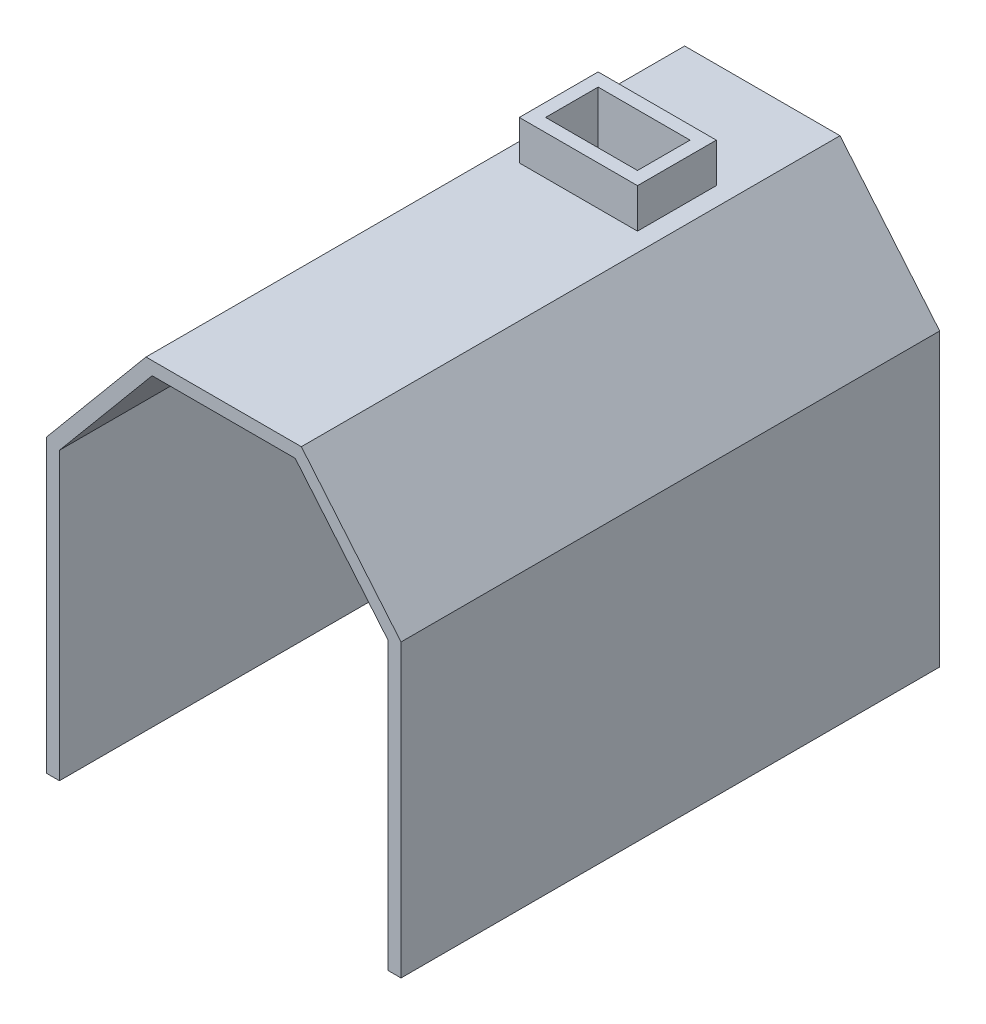
ISO-10303-21;
HEADER;
FILE_DESCRIPTION(('STEP AP214'),'2;1');
FILE_NAME('part.step','',(''),(''),'','','');
FILE_SCHEMA(('AUTOMOTIVE_DESIGN { 1 0 10303 214 1 1 1 1 }'));
ENDSEC;
DATA;
#1=APPLICATION_CONTEXT('core data for automotive mechanical design processes');
#2=APPLICATION_PROTOCOL_DEFINITION('international standard','automotive_design',2000,#1);
#3=PRODUCT_CONTEXT('',#1,'mechanical');
#4=PRODUCT('Part','Part','',(#3));
#5=PRODUCT_RELATED_PRODUCT_CATEGORY('part','',(#4));
#6=PRODUCT_DEFINITION_FORMATION('','',#4);
#7=PRODUCT_DEFINITION_CONTEXT('part definition',#1,'design');
#8=PRODUCT_DEFINITION('design','',#6,#7);
#9=PRODUCT_DEFINITION_SHAPE('','',#8);
#10=(LENGTH_UNIT() NAMED_UNIT(*) SI_UNIT(.MILLI.,.METRE.));
#11=(NAMED_UNIT(*) PLANE_ANGLE_UNIT() SI_UNIT($,.RADIAN.));
#12=(NAMED_UNIT(*) SI_UNIT($,.STERADIAN.) SOLID_ANGLE_UNIT());
#13=UNCERTAINTY_MEASURE_WITH_UNIT(LENGTH_MEASURE(1.E-05),#10,'distance_accuracy_value','');
#14=(GEOMETRIC_REPRESENTATION_CONTEXT(3) GLOBAL_UNCERTAINTY_ASSIGNED_CONTEXT((#13)) GLOBAL_UNIT_ASSIGNED_CONTEXT((#10,
#11,#12)) REPRESENTATION_CONTEXT('',''));
#15=CARTESIAN_POINT('',(0.,0.,0.));
#16=DIRECTION('',(0.,0.,1.));
#17=DIRECTION('',(1.,0.,0.));
#18=AXIS2_PLACEMENT_3D('',#15,#16,#17);
#19=CARTESIAN_POINT('',(-59.1248825999998,203.35,205.));
#20=DIRECTION('',(0.,-1.,0.));
#21=DIRECTION('',(0.,0.,-1.));
#22=AXIS2_PLACEMENT_3D('',#19,#20,#21);
#23=PLANE('',#22);
#24=DIRECTION('',(-1.,0.,0.));
#25=VECTOR('',#24,1.);
#26=CARTESIAN_POINT('',(-59.1248825999998,203.35,-205.));
#27=LINE('',#26,#25);
#28=CARTESIAN_POINT('',(59.1248825999997,203.35,-205.));
#29=VERTEX_POINT('',#28);
#30=CARTESIAN_POINT('',(-59.1248825999998,203.35,-205.));
#31=VERTEX_POINT('',#30);
#32=EDGE_CURVE('E340',#29,#31,#27,.T.);
#33=ORIENTED_EDGE('',*,*,#32,.T.);
#34=DIRECTION('',(0.,0.,-1.));
#35=VECTOR('',#34,1.);
#36=CARTESIAN_POINT('',(-59.1248825999998,203.35,205.));
#37=LINE('',#36,#35);
#38=CARTESIAN_POINT('',(-59.1248825999998,203.35,205.));
#39=VERTEX_POINT('',#38);
#40=EDGE_CURVE('E355',#39,#31,#37,.T.);
#41=ORIENTED_EDGE('',*,*,#40,.F.);
#42=DIRECTION('',(-1.,0.,0.));
#43=VECTOR('',#42,1.);
#44=CARTESIAN_POINT('',(-59.1248825999998,203.35,205.));
#45=LINE('',#44,#43);
#46=CARTESIAN_POINT('',(59.1248825999997,203.35,205.));
#47=VERTEX_POINT('',#46);
#48=EDGE_CURVE('E303',#47,#39,#45,.T.);
#49=ORIENTED_EDGE('',*,*,#48,.F.);
#50=DIRECTION('',(0.,0.,-1.));
#51=VECTOR('',#50,1.);
#52=CARTESIAN_POINT('',(59.1248825999997,203.35,205.));
#53=LINE('',#52,#51);
#54=EDGE_CURVE('E359',#47,#29,#53,.T.);
#55=ORIENTED_EDGE('',*,*,#54,.T.);
#56=EDGE_LOOP('',(#33,#41,#49,#55));
#57=FACE_BOUND('',#56,.T.);
#58=DIRECTION('',(1.,0.,0.));
#59=VECTOR('',#58,1.);
#60=CARTESIAN_POINT('',(-59.1248825999998,203.35,-65.));
#61=LINE('',#60,#59);
#62=CARTESIAN_POINT('',(-44.9749944578664,203.35,-65.));
#63=VERTEX_POINT('',#62);
#64=CARTESIAN_POINT('',(44.9749944578665,203.35,-65.));
#65=VERTEX_POINT('',#64);
#66=EDGE_CURVE('E214',#63,#65,#61,.T.);
#67=ORIENTED_EDGE('',*,*,#66,.F.);
#68=DIRECTION('',(0.,0.,1.));
#69=VECTOR('',#68,1.);
#70=CARTESIAN_POINT('',(-44.9749944578664,203.35,205.));
#71=LINE('',#70,#69);
#72=CARTESIAN_POINT('',(-44.9749944578664,203.35,-125.));
#73=VERTEX_POINT('',#72);
#74=EDGE_CURVE('E220',#73,#63,#71,.T.);
#75=ORIENTED_EDGE('',*,*,#74,.F.);
#76=DIRECTION('',(-1.,0.,0.));
#77=VECTOR('',#76,1.);
#78=CARTESIAN_POINT('',(-59.1248825999998,203.35,-125.));
#79=LINE('',#78,#77);
#80=CARTESIAN_POINT('',(44.9749944578665,203.35,-125.));
#81=VERTEX_POINT('',#80);
#82=EDGE_CURVE('E64',#81,#73,#79,.T.);
#83=ORIENTED_EDGE('',*,*,#82,.F.);
#84=DIRECTION('',(0.,0.,-1.));
#85=VECTOR('',#84,1.);
#86=CARTESIAN_POINT('',(44.9749944578665,203.35,205.));
#87=LINE('',#86,#85);
#88=EDGE_CURVE('E59',#65,#81,#87,.T.);
#89=ORIENTED_EDGE('',*,*,#88,.F.);
#90=EDGE_LOOP('',(#67,#75,#83,#89));
#91=FACE_BOUND('',#90,.T.);
#92=ADVANCED_FACE('F43',(#57,#91),#23,.F.);
#93=CARTESIAN_POINT('',(-54.4500000000001,193.35,205.));
#94=DIRECTION('',(0.,1.,0.));
#95=DIRECTION('',(0.,0.,1.));
#96=AXIS2_PLACEMENT_3D('',#93,#94,#95);
#97=PLANE('',#96);
#98=DIRECTION('',(1.,0.,0.));
#99=VECTOR('',#98,1.);
#100=CARTESIAN_POINT('',(-54.4500000000001,193.35,-205.));
#101=LINE('',#100,#99);
#102=CARTESIAN_POINT('',(-54.4500000000001,193.35,-205.));
#103=VERTEX_POINT('',#102);
#104=CARTESIAN_POINT('',(54.4499999999999,193.35,-205.));
#105=VERTEX_POINT('',#104);
#106=EDGE_CURVE('E322',#103,#105,#101,.T.);
#107=ORIENTED_EDGE('',*,*,#106,.T.);
#108=DIRECTION('',(0.,0.,-1.));
#109=VECTOR('',#108,1.);
#110=CARTESIAN_POINT('',(54.4499999999999,193.35,205.));
#111=LINE('',#110,#109);
#112=CARTESIAN_POINT('',(54.4499999999999,193.35,205.));
#113=VERTEX_POINT('',#112);
#114=EDGE_CURVE('E379',#113,#105,#111,.T.);
#115=ORIENTED_EDGE('',*,*,#114,.F.);
#116=DIRECTION('',(1.,0.,0.));
#117=VECTOR('',#116,1.);
#118=CARTESIAN_POINT('',(-54.4500000000001,193.35,205.));
#119=LINE('',#118,#117);
#120=CARTESIAN_POINT('',(-54.4500000000001,193.35,205.));
#121=VERTEX_POINT('',#120);
#122=EDGE_CURVE('E285',#121,#113,#119,.T.);
#123=ORIENTED_EDGE('',*,*,#122,.F.);
#124=DIRECTION('',(0.,0.,-1.));
#125=VECTOR('',#124,1.);
#126=CARTESIAN_POINT('',(-54.4500000000001,193.35,205.));
#127=LINE('',#126,#125);
#128=EDGE_CURVE('E383',#121,#103,#127,.T.);
#129=ORIENTED_EDGE('',*,*,#128,.T.);
#130=EDGE_LOOP('',(#107,#115,#123,#129));
#131=FACE_BOUND('',#130,.T.);
#132=DIRECTION('',(0.,0.,-1.));
#133=VECTOR('',#132,1.);
#134=CARTESIAN_POINT('',(-34.9749944578665,193.35,205.));
#135=LINE('',#134,#133);
#136=CARTESIAN_POINT('',(-34.9749944578664,193.35,-75.));
#137=VERTEX_POINT('',#136);
#138=CARTESIAN_POINT('',(-34.9749944578664,193.35,-115.));
#139=VERTEX_POINT('',#138);
#140=EDGE_CURVE('E269',#137,#139,#135,.T.);
#141=ORIENTED_EDGE('',*,*,#140,.F.);
#142=DIRECTION('',(-1.,0.,0.));
#143=VECTOR('',#142,1.);
#144=CARTESIAN_POINT('',(-54.4500000000001,193.35,-75.));
#145=LINE('',#144,#143);
#146=CARTESIAN_POINT('',(34.9749944578665,193.35,-75.0000000000001));
#147=VERTEX_POINT('',#146);
#148=EDGE_CURVE('E266',#147,#137,#145,.T.);
#149=ORIENTED_EDGE('',*,*,#148,.F.);
#150=DIRECTION('',(0.,0.,1.));
#151=VECTOR('',#150,1.);
#152=CARTESIAN_POINT('',(34.9749944578665,193.35,205.));
#153=LINE('',#152,#151);
#154=CARTESIAN_POINT('',(34.9749944578665,193.35,-115.));
#155=VERTEX_POINT('',#154);
#156=EDGE_CURVE('E187',#155,#147,#153,.T.);
#157=ORIENTED_EDGE('',*,*,#156,.F.);
#158=DIRECTION('',(1.,0.,0.));
#159=VECTOR('',#158,1.);
#160=CARTESIAN_POINT('',(-54.4500000000001,193.35,-115.));
#161=LINE('',#160,#159);
#162=EDGE_CURVE('E261',#139,#155,#161,.T.);
#163=ORIENTED_EDGE('',*,*,#162,.F.);
#164=EDGE_LOOP('',(#141,#149,#157,#163));
#165=FACE_BOUND('',#164,.T.);
#166=ADVANCED_FACE('F403',(#131,#165),#97,.F.);
#167=CARTESIAN_POINT('',(-135.,-108.94,205.));
#168=DIRECTION('',(0.,1.,0.));
#169=DIRECTION('',(-1.,0.,0.));
#170=AXIS2_PLACEMENT_3D('',#167,#168,#169);
#171=PLANE('',#170);
#172=DIRECTION('',(1.,0.,0.));
#173=VECTOR('',#172,1.);
#174=CARTESIAN_POINT('',(-135.,-108.94,-205.));
#175=LINE('',#174,#173);
#176=CARTESIAN_POINT('',(-135.,-108.94,-205.));
#177=VERTEX_POINT('',#176);
#178=CARTESIAN_POINT('',(-125.,-108.94,-205.));
#179=VERTEX_POINT('',#178);
#180=EDGE_CURVE('E273',#177,#179,#175,.T.);
#181=ORIENTED_EDGE('',*,*,#180,.T.);
#182=DIRECTION('',(0.,0.,-1.));
#183=VECTOR('',#182,1.);
#184=CARTESIAN_POINT('',(-125.,-108.94,205.));
#185=LINE('',#184,#183);
#186=CARTESIAN_POINT('',(-125.,-108.94,205.));
#187=VERTEX_POINT('',#186);
#188=EDGE_CURVE('E11',#187,#179,#185,.T.);
#189=ORIENTED_EDGE('',*,*,#188,.F.);
#190=DIRECTION('',(1.,0.,0.));
#191=VECTOR('',#190,1.);
#192=CARTESIAN_POINT('',(-135.,-108.94,205.));
#193=LINE('',#192,#191);
#194=CARTESIAN_POINT('',(-135.,-108.94,205.));
#195=VERTEX_POINT('',#194);
#196=EDGE_CURVE('E274',#195,#187,#193,.T.);
#197=ORIENTED_EDGE('',*,*,#196,.F.);
#198=DIRECTION('',(0.,0.,-1.));
#199=VECTOR('',#198,1.);
#200=CARTESIAN_POINT('',(-135.,-108.94,205.));
#201=LINE('',#200,#199);
#202=EDGE_CURVE('E312',#195,#177,#201,.T.);
#203=ORIENTED_EDGE('',*,*,#202,.T.);
#204=EDGE_LOOP('',(#181,#189,#197,#203));
#205=FACE_BOUND('',#204,.T.);
#206=ADVANCED_FACE('F45',(#205),#171,.F.);
#207=CARTESIAN_POINT('',(-125.,108.94,205.));
#208=DIRECTION('',(-1.,0.,0.));
#209=DIRECTION('',(0.,-1.,0.));
#210=AXIS2_PLACEMENT_3D('',#207,#208,#209);
#211=PLANE('',#210);
#212=DIRECTION('',(0.,1.,0.));
#213=VECTOR('',#212,1.);
#214=CARTESIAN_POINT('',(-125.,108.94,-205.));
#215=LINE('',#214,#213);
#216=CARTESIAN_POINT('',(-125.,108.94,-205.));
#217=VERTEX_POINT('',#216);
#218=EDGE_CURVE('E316',#179,#217,#215,.T.);
#219=ORIENTED_EDGE('',*,*,#218,.T.);
#220=DIRECTION('',(0.,0.,-1.));
#221=VECTOR('',#220,1.);
#222=CARTESIAN_POINT('',(-125.,108.94,205.));
#223=LINE('',#222,#221);
#224=CARTESIAN_POINT('',(-125.,108.94,205.));
#225=VERTEX_POINT('',#224);
#226=EDGE_CURVE('E52',#225,#217,#223,.T.);
#227=ORIENTED_EDGE('',*,*,#226,.F.);
#228=DIRECTION('',(0.,1.,0.));
#229=VECTOR('',#228,1.);
#230=CARTESIAN_POINT('',(-125.,108.94,205.));
#231=LINE('',#230,#229);
#232=EDGE_CURVE('E278',#187,#225,#231,.T.);
#233=ORIENTED_EDGE('',*,*,#232,.F.);
#234=ORIENTED_EDGE('',*,*,#188,.T.);
#235=EDGE_LOOP('',(#219,#227,#233,#234));
#236=FACE_BOUND('',#235,.T.);
#237=ADVANCED_FACE('F416',(#236),#211,.F.);
#238=CARTESIAN_POINT('',(-125.,108.94,205.));
#239=DIRECTION('',(-0.767289111479314,0.641301348357607,0.));
#240=DIRECTION('',(-0.641301348357607,-0.767289111479314,0.));
#241=AXIS2_PLACEMENT_3D('',#238,#239,#240);
#242=PLANE('',#241);
#243=DIRECTION('',(0.641301348357607,0.767289111479314,0.));
#244=VECTOR('',#243,1.);
#245=CARTESIAN_POINT('',(-125.,108.94,-205.));
#246=LINE('',#245,#244);
#247=EDGE_CURVE('E319',#217,#103,#246,.T.);
#248=ORIENTED_EDGE('',*,*,#247,.T.);
#249=ORIENTED_EDGE('',*,*,#128,.F.);
#250=DIRECTION('',(0.641301348357607,0.767289111479314,0.));
#251=VECTOR('',#250,1.);
#252=CARTESIAN_POINT('',(-125.,108.94,205.));
#253=LINE('',#252,#251);
#254=EDGE_CURVE('E282',#225,#121,#253,.T.);
#255=ORIENTED_EDGE('',*,*,#254,.F.);
#256=ORIENTED_EDGE('',*,*,#226,.T.);
#257=EDGE_LOOP('',(#248,#249,#255,#256));
#258=FACE_BOUND('',#257,.T.);
#259=ADVANCED_FACE('F392',(#258),#242,.F.);
#260=CARTESIAN_POINT('',(125.,108.94,205.));
#261=DIRECTION('',(0.767289111479314,0.641301348357607,0.));
#262=DIRECTION('',(-0.641301348357607,0.767289111479314,0.));
#263=AXIS2_PLACEMENT_3D('',#260,#261,#262);
#264=PLANE('',#263);
#265=DIRECTION('',(0.641301348357607,-0.767289111479314,0.));
#266=VECTOR('',#265,1.);
#267=CARTESIAN_POINT('',(125.,108.94,-205.));
#268=LINE('',#267,#266);
#269=CARTESIAN_POINT('',(125.,108.94,-205.));
#270=VERTEX_POINT('',#269);
#271=EDGE_CURVE('E325',#105,#270,#268,.T.);
#272=ORIENTED_EDGE('',*,*,#271,.T.);
#273=DIRECTION('',(0.,0.,-1.));
#274=VECTOR('',#273,1.);
#275=CARTESIAN_POINT('',(125.,108.94,205.));
#276=LINE('',#275,#274);
#277=CARTESIAN_POINT('',(125.,108.94,205.));
#278=VERTEX_POINT('',#277);
#279=EDGE_CURVE('E375',#278,#270,#276,.T.);
#280=ORIENTED_EDGE('',*,*,#279,.F.);
#281=DIRECTION('',(0.641301348357607,-0.767289111479314,0.));
#282=VECTOR('',#281,1.);
#283=CARTESIAN_POINT('',(125.,108.94,205.));
#284=LINE('',#283,#282);
#285=EDGE_CURVE('E288',#113,#278,#284,.T.);
#286=ORIENTED_EDGE('',*,*,#285,.F.);
#287=ORIENTED_EDGE('',*,*,#114,.T.);
#288=EDGE_LOOP('',(#272,#280,#286,#287));
#289=FACE_BOUND('',#288,.T.);
#290=ADVANCED_FACE('F408',(#289),#264,.F.);
#291=CARTESIAN_POINT('',(125.,108.94,205.));
#292=DIRECTION('',(1.,0.,0.));
#293=DIRECTION('',(0.,1.,0.));
#294=AXIS2_PLACEMENT_3D('',#291,#292,#293);
#295=PLANE('',#294);
#296=DIRECTION('',(0.,-1.,0.));
#297=VECTOR('',#296,1.);
#298=CARTESIAN_POINT('',(125.,108.94,-205.));
#299=LINE('',#298,#297);
#300=CARTESIAN_POINT('',(125.,-108.94,-205.));
#301=VERTEX_POINT('',#300);
#302=EDGE_CURVE('E328',#270,#301,#299,.T.);
#303=ORIENTED_EDGE('',*,*,#302,.T.);
#304=DIRECTION('',(0.,0.,-1.));
#305=VECTOR('',#304,1.);
#306=CARTESIAN_POINT('',(125.,-108.94,205.));
#307=LINE('',#306,#305);
#308=CARTESIAN_POINT('',(125.,-108.94,205.));
#309=VERTEX_POINT('',#308);
#310=EDGE_CURVE('E371',#309,#301,#307,.T.);
#311=ORIENTED_EDGE('',*,*,#310,.F.);
#312=DIRECTION('',(0.,-1.,0.));
#313=VECTOR('',#312,1.);
#314=CARTESIAN_POINT('',(125.,108.94,205.));
#315=LINE('',#314,#313);
#316=EDGE_CURVE('E291',#278,#309,#315,.T.);
#317=ORIENTED_EDGE('',*,*,#316,.F.);
#318=ORIENTED_EDGE('',*,*,#279,.T.);
#319=EDGE_LOOP('',(#303,#311,#317,#318));
#320=FACE_BOUND('',#319,.T.);
#321=ADVANCED_FACE('F448',(#320),#295,.F.);
#322=CARTESIAN_POINT('',(125.,-108.94,205.));
#323=DIRECTION('',(0.,1.,0.));
#324=DIRECTION('',(0.,0.,1.));
#325=AXIS2_PLACEMENT_3D('',#322,#323,#324);
#326=PLANE('',#325);
#327=DIRECTION('',(1.,0.,0.));
#328=VECTOR('',#327,1.);
#329=CARTESIAN_POINT('',(125.,-108.94,-205.));
#330=LINE('',#329,#328);
#331=CARTESIAN_POINT('',(135.,-108.94,-205.));
#332=VERTEX_POINT('',#331);
#333=EDGE_CURVE('E331',#301,#332,#330,.T.);
#334=ORIENTED_EDGE('',*,*,#333,.T.);
#335=DIRECTION('',(0.,0.,-1.));
#336=VECTOR('',#335,1.);
#337=CARTESIAN_POINT('',(135.,-108.94,205.));
#338=LINE('',#337,#336);
#339=CARTESIAN_POINT('',(135.,-108.94,205.));
#340=VERTEX_POINT('',#339);
#341=EDGE_CURVE('E367',#340,#332,#338,.T.);
#342=ORIENTED_EDGE('',*,*,#341,.F.);
#343=DIRECTION('',(1.,0.,0.));
#344=VECTOR('',#343,1.);
#345=CARTESIAN_POINT('',(125.,-108.94,205.));
#346=LINE('',#345,#344);
#347=EDGE_CURVE('E294',#309,#340,#346,.T.);
#348=ORIENTED_EDGE('',*,*,#347,.F.);
#349=ORIENTED_EDGE('',*,*,#310,.T.);
#350=EDGE_LOOP('',(#334,#342,#348,#349));
#351=FACE_BOUND('',#350,.T.);
#352=ADVANCED_FACE('F446',(#351),#326,.F.);
#353=CARTESIAN_POINT('',(135.,112.568729132048,205.));
#354=DIRECTION('',(-1.,0.,0.));
#355=DIRECTION('',(0.,0.,1.));
#356=AXIS2_PLACEMENT_3D('',#353,#354,#355);
#357=PLANE('',#356);
#358=DIRECTION('',(0.,1.,0.));
#359=VECTOR('',#358,1.);
#360=CARTESIAN_POINT('',(135.,112.568729132048,-205.));
#361=LINE('',#360,#359);
#362=CARTESIAN_POINT('',(135.,112.568729132048,-205.));
#363=VERTEX_POINT('',#362);
#364=EDGE_CURVE('E334',#332,#363,#361,.T.);
#365=ORIENTED_EDGE('',*,*,#364,.T.);
#366=DIRECTION('',(0.,0.,-1.));
#367=VECTOR('',#366,1.);
#368=CARTESIAN_POINT('',(135.,112.568729132048,205.));
#369=LINE('',#368,#367);
#370=CARTESIAN_POINT('',(135.,112.568729132048,205.));
#371=VERTEX_POINT('',#370);
#372=EDGE_CURVE('E363',#371,#363,#369,.T.);
#373=ORIENTED_EDGE('',*,*,#372,.F.);
#374=DIRECTION('',(0.,1.,0.));
#375=VECTOR('',#374,1.);
#376=CARTESIAN_POINT('',(135.,112.568729132048,205.));
#377=LINE('',#376,#375);
#378=EDGE_CURVE('E297',#340,#371,#377,.T.);
#379=ORIENTED_EDGE('',*,*,#378,.F.);
#380=ORIENTED_EDGE('',*,*,#341,.T.);
#381=EDGE_LOOP('',(#365,#373,#379,#380));
#382=FACE_BOUND('',#381,.T.);
#383=ADVANCED_FACE('F442',(#382),#357,.F.);
#384=CARTESIAN_POINT('',(135.,112.568729132048,205.));
#385=DIRECTION('',(-0.767289111479314,-0.641301348357607,0.));
#386=DIRECTION('',(0.641301348357607,-0.767289111479314,0.));
#387=AXIS2_PLACEMENT_3D('',#384,#385,#386);
#388=PLANE('',#387);
#389=DIRECTION('',(-0.641301348357607,0.767289111479314,0.));
#390=VECTOR('',#389,1.);
#391=CARTESIAN_POINT('',(135.,112.568729132048,-205.));
#392=LINE('',#391,#390);
#393=EDGE_CURVE('E337',#363,#29,#392,.T.);
#394=ORIENTED_EDGE('',*,*,#393,.T.);
#395=ORIENTED_EDGE('',*,*,#54,.F.);
#396=DIRECTION('',(-0.641301348357607,0.767289111479314,0.));
#397=VECTOR('',#396,1.);
#398=CARTESIAN_POINT('',(135.,112.568729132048,205.));
#399=LINE('',#398,#397);
#400=EDGE_CURVE('E300',#371,#47,#399,.T.);
#401=ORIENTED_EDGE('',*,*,#400,.F.);
#402=ORIENTED_EDGE('',*,*,#372,.T.);
#403=EDGE_LOOP('',(#394,#395,#401,#402));
#404=FACE_BOUND('',#403,.T.);
#405=ADVANCED_FACE('F437',(#404),#388,.F.);
#406=CARTESIAN_POINT('',(-135.,112.568729132048,205.));
#407=DIRECTION('',(0.767289111479314,-0.641301348357607,0.));
#408=DIRECTION('',(0.641301348357607,0.767289111479314,0.));
#409=AXIS2_PLACEMENT_3D('',#406,#407,#408);
#410=PLANE('',#409);
#411=DIRECTION('',(-0.641301348357607,-0.767289111479314,0.));
#412=VECTOR('',#411,1.);
#413=CARTESIAN_POINT('',(-135.,112.568729132048,-205.));
#414=LINE('',#413,#412);
#415=CARTESIAN_POINT('',(-135.,112.568729132048,-205.));
#416=VERTEX_POINT('',#415);
#417=EDGE_CURVE('E343',#31,#416,#414,.T.);
#418=ORIENTED_EDGE('',*,*,#417,.T.);
#419=DIRECTION('',(0.,0.,-1.));
#420=VECTOR('',#419,1.);
#421=CARTESIAN_POINT('',(-135.,112.568729132048,205.));
#422=LINE('',#421,#420);
#423=CARTESIAN_POINT('',(-135.,112.568729132048,205.));
#424=VERTEX_POINT('',#423);
#425=EDGE_CURVE('E351',#424,#416,#422,.T.);
#426=ORIENTED_EDGE('',*,*,#425,.F.);
#427=DIRECTION('',(-0.641301348357607,-0.767289111479314,0.));
#428=VECTOR('',#427,1.);
#429=CARTESIAN_POINT('',(-135.,112.568729132048,205.));
#430=LINE('',#429,#428);
#431=EDGE_CURVE('E306',#39,#424,#430,.T.);
#432=ORIENTED_EDGE('',*,*,#431,.F.);
#433=ORIENTED_EDGE('',*,*,#40,.T.);
#434=EDGE_LOOP('',(#418,#426,#432,#433));
#435=FACE_BOUND('',#434,.T.);
#436=ADVANCED_FACE('F428',(#435),#410,.F.);
#437=CARTESIAN_POINT('',(-135.,112.568729132048,205.));
#438=DIRECTION('',(1.,0.,0.));
#439=DIRECTION('',(0.,0.,-1.));
#440=AXIS2_PLACEMENT_3D('',#437,#438,#439);
#441=PLANE('',#440);
#442=DIRECTION('',(0.,-1.,0.));
#443=VECTOR('',#442,1.);
#444=CARTESIAN_POINT('',(-135.,112.568729132048,-205.));
#445=LINE('',#444,#443);
#446=EDGE_CURVE('E279',#416,#177,#445,.T.);
#447=ORIENTED_EDGE('',*,*,#446,.T.);
#448=ORIENTED_EDGE('',*,*,#202,.F.);
#449=DIRECTION('',(0.,-1.,0.));
#450=VECTOR('',#449,1.);
#451=CARTESIAN_POINT('',(-135.,112.568729132048,205.));
#452=LINE('',#451,#450);
#453=EDGE_CURVE('E309',#424,#195,#452,.T.);
#454=ORIENTED_EDGE('',*,*,#453,.F.);
#455=ORIENTED_EDGE('',*,*,#425,.T.);
#456=EDGE_LOOP('',(#447,#448,#454,#455));
#457=FACE_BOUND('',#456,.T.);
#458=ADVANCED_FACE('F423',(#457),#441,.F.);
#459=CARTESIAN_POINT('',(0.,0.,205.));
#460=DIRECTION('',(0.,0.,-1.));
#461=DIRECTION('',(-1.,0.,0.));
#462=AXIS2_PLACEMENT_3D('',#459,#460,#461);
#463=PLANE('',#462);
#464=ORIENTED_EDGE('',*,*,#196,.T.);
#465=ORIENTED_EDGE('',*,*,#232,.T.);
#466=ORIENTED_EDGE('',*,*,#254,.T.);
#467=ORIENTED_EDGE('',*,*,#122,.T.);
#468=ORIENTED_EDGE('',*,*,#285,.T.);
#469=ORIENTED_EDGE('',*,*,#316,.T.);
#470=ORIENTED_EDGE('',*,*,#347,.T.);
#471=ORIENTED_EDGE('',*,*,#378,.T.);
#472=ORIENTED_EDGE('',*,*,#400,.T.);
#473=ORIENTED_EDGE('',*,*,#48,.T.);
#474=ORIENTED_EDGE('',*,*,#431,.T.);
#475=ORIENTED_EDGE('',*,*,#453,.T.);
#476=EDGE_LOOP('',(#464,#465,#466,#467,#468,#469,#470,#471,#472,#473,#474,#475));
#477=FACE_BOUND('',#476,.T.);
#478=ADVANCED_FACE('F412',(#477),#463,.F.);
#479=CARTESIAN_POINT('',(0.,0.,-205.));
#480=DIRECTION('',(0.,0.,-1.));
#481=DIRECTION('',(-1.,0.,0.));
#482=AXIS2_PLACEMENT_3D('',#479,#480,#481);
#483=PLANE('',#482);
#484=ORIENTED_EDGE('',*,*,#180,.F.);
#485=ORIENTED_EDGE('',*,*,#446,.F.);
#486=ORIENTED_EDGE('',*,*,#417,.F.);
#487=ORIENTED_EDGE('',*,*,#32,.F.);
#488=ORIENTED_EDGE('',*,*,#393,.F.);
#489=ORIENTED_EDGE('',*,*,#364,.F.);
#490=ORIENTED_EDGE('',*,*,#333,.F.);
#491=ORIENTED_EDGE('',*,*,#302,.F.);
#492=ORIENTED_EDGE('',*,*,#271,.F.);
#493=ORIENTED_EDGE('',*,*,#106,.F.);
#494=ORIENTED_EDGE('',*,*,#247,.F.);
#495=ORIENTED_EDGE('',*,*,#218,.F.);
#496=EDGE_LOOP('',(#484,#485,#486,#487,#488,#489,#490,#491,#492,#493,#494,#495));
#497=FACE_BOUND('',#496,.T.);
#498=ADVANCED_FACE('F398',(#497),#483,.T.);
#499=CARTESIAN_POINT('',(-34.9749944578664,203.35,-115.));
#500=DIRECTION('',(1.,0.,0.));
#501=DIRECTION('',(0.,0.,-1.));
#502=AXIS2_PLACEMENT_3D('',#499,#500,#501);
#503=PLANE('',#502);
#504=ORIENTED_EDGE('',*,*,#140,.T.);
#505=DIRECTION('',(0.,-1.,0.));
#506=VECTOR('',#505,1.);
#507=CARTESIAN_POINT('',(-34.9749944578664,203.35,-115.));
#508=LINE('',#507,#506);
#509=CARTESIAN_POINT('',(-34.9749944578664,233.35,-115.));
#510=VERTEX_POINT('',#509);
#511=EDGE_CURVE('E254',#510,#139,#508,.T.);
#512=ORIENTED_EDGE('',*,*,#511,.F.);
#513=DIRECTION('',(0.,0.,1.));
#514=VECTOR('',#513,1.);
#515=CARTESIAN_POINT('',(-34.9749944578665,233.35,205.));
#516=LINE('',#515,#514);
#517=CARTESIAN_POINT('',(-34.9749944578664,233.35,-75.));
#518=VERTEX_POINT('',#517);
#519=EDGE_CURVE('E209',#510,#518,#516,.T.);
#520=ORIENTED_EDGE('',*,*,#519,.T.);
#521=DIRECTION('',(0.,-1.,0.));
#522=VECTOR('',#521,1.);
#523=CARTESIAN_POINT('',(-34.9749944578664,203.35,-75.));
#524=LINE('',#523,#522);
#525=EDGE_CURVE('E191',#518,#137,#524,.T.);
#526=ORIENTED_EDGE('',*,*,#525,.T.);
#527=EDGE_LOOP('',(#504,#512,#520,#526));
#528=FACE_BOUND('',#527,.T.);
#529=ADVANCED_FACE('F499',(#528),#503,.T.);
#530=CARTESIAN_POINT('',(34.9749944578665,203.35,-75.0000000000001));
#531=DIRECTION('',(0.,0.,-1.));
#532=DIRECTION('',(-1.,0.,0.));
#533=AXIS2_PLACEMENT_3D('',#530,#531,#532);
#534=PLANE('',#533);
#535=ORIENTED_EDGE('',*,*,#148,.T.);
#536=ORIENTED_EDGE('',*,*,#525,.F.);
#537=DIRECTION('',(1.,0.,0.));
#538=VECTOR('',#537,1.);
#539=CARTESIAN_POINT('',(-59.1248825999999,233.35,-75.));
#540=LINE('',#539,#538);
#541=CARTESIAN_POINT('',(34.9749944578665,233.35,-75.0000000000001));
#542=VERTEX_POINT('',#541);
#543=EDGE_CURVE('E195',#518,#542,#540,.T.);
#544=ORIENTED_EDGE('',*,*,#543,.T.);
#545=DIRECTION('',(0.,-1.,0.));
#546=VECTOR('',#545,1.);
#547=CARTESIAN_POINT('',(34.9749944578665,203.35,-75.0000000000001));
#548=LINE('',#547,#546);
#549=EDGE_CURVE('E179',#542,#147,#548,.T.);
#550=ORIENTED_EDGE('',*,*,#549,.T.);
#551=EDGE_LOOP('',(#535,#536,#544,#550));
#552=FACE_BOUND('',#551,.T.);
#553=ADVANCED_FACE('F196',(#552),#534,.T.);
#554=CARTESIAN_POINT('',(34.9749944578665,203.35,-115.));
#555=DIRECTION('',(-1.,0.,0.));
#556=DIRECTION('',(0.,0.,1.));
#557=AXIS2_PLACEMENT_3D('',#554,#555,#556);
#558=PLANE('',#557);
#559=ORIENTED_EDGE('',*,*,#156,.T.);
#560=ORIENTED_EDGE('',*,*,#549,.F.);
#561=DIRECTION('',(0.,0.,-1.));
#562=VECTOR('',#561,1.);
#563=CARTESIAN_POINT('',(34.9749944578665,233.35,205.));
#564=LINE('',#563,#562);
#565=CARTESIAN_POINT('',(34.9749944578665,233.35,-115.));
#566=VERTEX_POINT('',#565);
#567=EDGE_CURVE('E184',#542,#566,#564,.T.);
#568=ORIENTED_EDGE('',*,*,#567,.T.);
#569=DIRECTION('',(0.,-1.,0.));
#570=VECTOR('',#569,1.);
#571=CARTESIAN_POINT('',(34.9749944578665,203.35,-115.));
#572=LINE('',#571,#570);
#573=EDGE_CURVE('E192',#566,#155,#572,.T.);
#574=ORIENTED_EDGE('',*,*,#573,.T.);
#575=EDGE_LOOP('',(#559,#560,#568,#574));
#576=FACE_BOUND('',#575,.T.);
#577=ADVANCED_FACE('F181',(#576),#558,.T.);
#578=CARTESIAN_POINT('',(34.9749944578665,203.35,-115.));
#579=DIRECTION('',(0.,0.,1.));
#580=DIRECTION('',(1.,0.,0.));
#581=AXIS2_PLACEMENT_3D('',#578,#579,#580);
#582=PLANE('',#581);
#583=ORIENTED_EDGE('',*,*,#162,.T.);
#584=ORIENTED_EDGE('',*,*,#573,.F.);
#585=DIRECTION('',(-1.,0.,0.));
#586=VECTOR('',#585,1.);
#587=CARTESIAN_POINT('',(-59.1248825999999,233.35,-115.));
#588=LINE('',#587,#586);
#589=EDGE_CURVE('E205',#566,#510,#588,.T.);
#590=ORIENTED_EDGE('',*,*,#589,.T.);
#591=ORIENTED_EDGE('',*,*,#511,.T.);
#592=EDGE_LOOP('',(#583,#584,#590,#591));
#593=FACE_BOUND('',#592,.T.);
#594=ADVANCED_FACE('F520',(#593),#582,.T.);
#595=CARTESIAN_POINT('',(0.,233.35,0.));
#596=DIRECTION('',(0.,1.,0.));
#597=DIRECTION('',(0.,0.,1.));
#598=AXIS2_PLACEMENT_3D('',#595,#596,#597);
#599=PLANE('',#598);
#600=DIRECTION('',(1.,0.,0.));
#601=VECTOR('',#600,1.);
#602=CARTESIAN_POINT('',(-59.1248825999998,233.35,-65.));
#603=LINE('',#602,#601);
#604=CARTESIAN_POINT('',(-44.9749944578664,233.35,-65.));
#605=VERTEX_POINT('',#604);
#606=CARTESIAN_POINT('',(44.9749944578665,233.35,-65.));
#607=VERTEX_POINT('',#606);
#608=EDGE_CURVE('E215',#605,#607,#603,.T.);
#609=ORIENTED_EDGE('',*,*,#608,.T.);
#610=DIRECTION('',(0.,0.,-1.));
#611=VECTOR('',#610,1.);
#612=CARTESIAN_POINT('',(44.9749944578665,233.35,205.));
#613=LINE('',#612,#611);
#614=CARTESIAN_POINT('',(44.9749944578665,233.35,-125.));
#615=VERTEX_POINT('',#614);
#616=EDGE_CURVE('E219',#607,#615,#613,.T.);
#617=ORIENTED_EDGE('',*,*,#616,.T.);
#618=DIRECTION('',(-1.,0.,0.));
#619=VECTOR('',#618,1.);
#620=CARTESIAN_POINT('',(-59.1248825999998,233.35,-125.));
#621=LINE('',#620,#619);
#622=CARTESIAN_POINT('',(-44.9749944578664,233.35,-125.));
#623=VERTEX_POINT('',#622);
#624=EDGE_CURVE('E223',#615,#623,#621,.T.);
#625=ORIENTED_EDGE('',*,*,#624,.T.);
#626=DIRECTION('',(0.,0.,1.));
#627=VECTOR('',#626,1.);
#628=CARTESIAN_POINT('',(-44.9749944578664,233.35,205.));
#629=LINE('',#628,#627);
#630=EDGE_CURVE('E226',#623,#605,#629,.T.);
#631=ORIENTED_EDGE('',*,*,#630,.T.);
#632=EDGE_LOOP('',(#609,#617,#625,#631));
#633=FACE_BOUND('',#632,.T.);
#634=ORIENTED_EDGE('',*,*,#567,.F.);
#635=ORIENTED_EDGE('',*,*,#543,.F.);
#636=ORIENTED_EDGE('',*,*,#519,.F.);
#637=ORIENTED_EDGE('',*,*,#589,.F.);
#638=EDGE_LOOP('',(#634,#635,#636,#637));
#639=FACE_BOUND('',#638,.T.);
#640=ADVANCED_FACE('F203',(#633,#639),#599,.T.);
#641=CARTESIAN_POINT('',(-59.1248825999998,233.35,-65.));
#642=DIRECTION('',(0.,0.,-1.));
#643=DIRECTION('',(-1.,0.,0.));
#644=AXIS2_PLACEMENT_3D('',#641,#642,#643);
#645=PLANE('',#644);
#646=ORIENTED_EDGE('',*,*,#66,.T.);
#647=DIRECTION('',(0.,-1.,0.));
#648=VECTOR('',#647,1.);
#649=CARTESIAN_POINT('',(44.9749944578665,233.35,-65.));
#650=LINE('',#649,#648);
#651=EDGE_CURVE('E251',#607,#65,#650,.T.);
#652=ORIENTED_EDGE('',*,*,#651,.F.);
#653=ORIENTED_EDGE('',*,*,#608,.F.);
#654=DIRECTION('',(0.,-1.,0.));
#655=VECTOR('',#654,1.);
#656=CARTESIAN_POINT('',(-44.9749944578664,233.35,-65.));
#657=LINE('',#656,#655);
#658=EDGE_CURVE('E229',#605,#63,#657,.T.);
#659=ORIENTED_EDGE('',*,*,#658,.T.);
#660=EDGE_LOOP('',(#646,#652,#653,#659));
#661=FACE_BOUND('',#660,.T.);
#662=ADVANCED_FACE('F534',(#661),#645,.F.);
#663=CARTESIAN_POINT('',(44.9749944578665,233.35,205.));
#664=DIRECTION('',(-1.,0.,0.));
#665=DIRECTION('',(0.,0.,1.));
#666=AXIS2_PLACEMENT_3D('',#663,#664,#665);
#667=PLANE('',#666);
#668=ORIENTED_EDGE('',*,*,#88,.T.);
#669=DIRECTION('',(0.,-1.,0.));
#670=VECTOR('',#669,1.);
#671=CARTESIAN_POINT('',(44.9749944578665,233.35,-125.));
#672=LINE('',#671,#670);
#673=EDGE_CURVE('E247',#615,#81,#672,.T.);
#674=ORIENTED_EDGE('',*,*,#673,.F.);
#675=ORIENTED_EDGE('',*,*,#616,.F.);
#676=ORIENTED_EDGE('',*,*,#651,.T.);
#677=EDGE_LOOP('',(#668,#674,#675,#676));
#678=FACE_BOUND('',#677,.T.);
#679=ADVANCED_FACE('F542',(#678),#667,.F.);
#680=CARTESIAN_POINT('',(-59.1248825999998,233.35,-125.));
#681=DIRECTION('',(0.,0.,1.));
#682=DIRECTION('',(1.,0.,0.));
#683=AXIS2_PLACEMENT_3D('',#680,#681,#682);
#684=PLANE('',#683);
#685=ORIENTED_EDGE('',*,*,#82,.T.);
#686=DIRECTION('',(0.,-1.,0.));
#687=VECTOR('',#686,1.);
#688=CARTESIAN_POINT('',(-44.9749944578664,233.35,-125.));
#689=LINE('',#688,#687);
#690=EDGE_CURVE('E243',#623,#73,#689,.T.);
#691=ORIENTED_EDGE('',*,*,#690,.F.);
#692=ORIENTED_EDGE('',*,*,#624,.F.);
#693=ORIENTED_EDGE('',*,*,#673,.T.);
#694=EDGE_LOOP('',(#685,#691,#692,#693));
#695=FACE_BOUND('',#694,.T.);
#696=ADVANCED_FACE('F550',(#695),#684,.F.);
#697=CARTESIAN_POINT('',(-44.9749944578664,233.35,205.));
#698=DIRECTION('',(1.,0.,0.));
#699=DIRECTION('',(0.,0.,-1.));
#700=AXIS2_PLACEMENT_3D('',#697,#698,#699);
#701=PLANE('',#700);
#702=ORIENTED_EDGE('',*,*,#74,.T.);
#703=ORIENTED_EDGE('',*,*,#658,.F.);
#704=ORIENTED_EDGE('',*,*,#630,.F.);
#705=ORIENTED_EDGE('',*,*,#690,.T.);
#706=EDGE_LOOP('',(#702,#703,#704,#705));
#707=FACE_BOUND('',#706,.T.);
#708=ADVANCED_FACE('F558',(#707),#701,.F.);
#709=CLOSED_SHELL('',(#92,#166,#206,#237,#259,#290,#321,#352,#383,#405,#436,#458,#478,#498,#529,
#553,#577,#594,#640,#662,#679,#696,#708));
#710=MANIFOLD_SOLID_BREP('B2',#709);
#711=ADVANCED_BREP_SHAPE_REPRESENTATION('',(#18,#710),#14);
#712=SHAPE_DEFINITION_REPRESENTATION(#9,#711);
ENDSEC;
END-ISO-10303-21;
